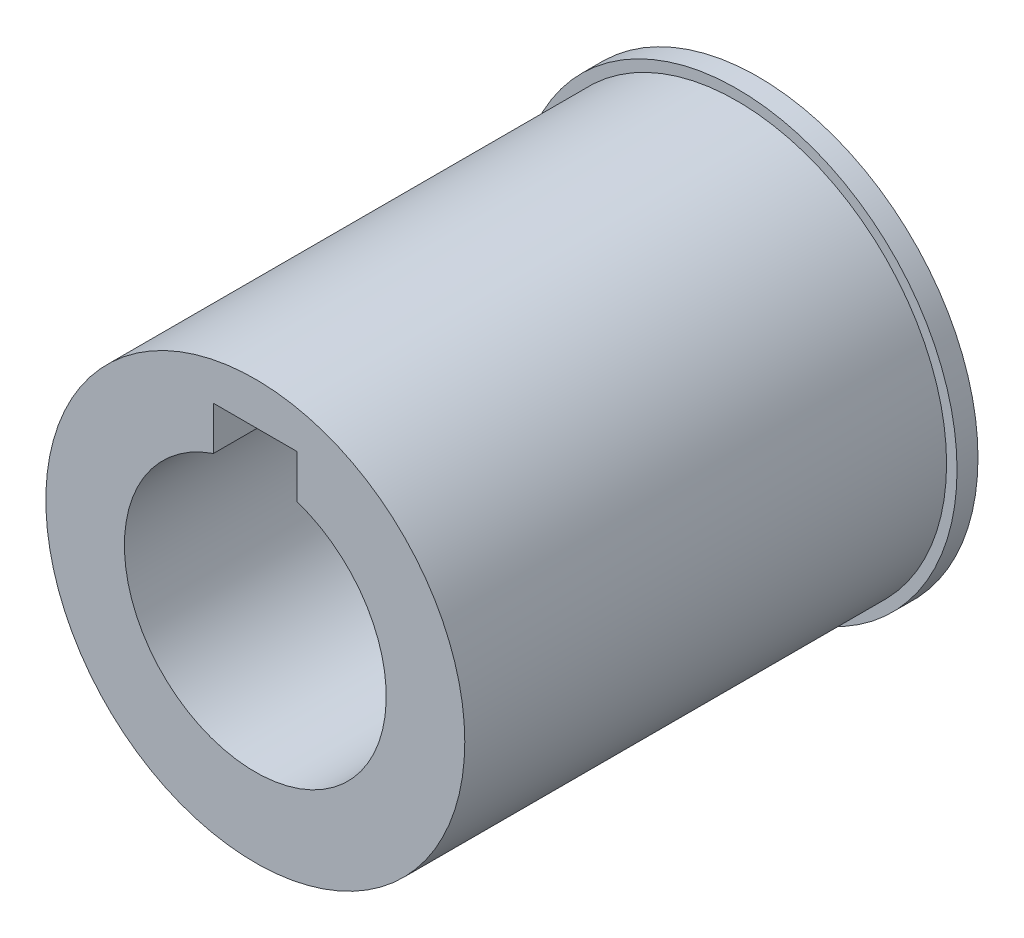
ISO-10303-21;
HEADER;
FILE_DESCRIPTION(('STEP AP214'),'2;1');
FILE_NAME('part.step','',(''),(''),'','','');
FILE_SCHEMA(('AUTOMOTIVE_DESIGN { 1 0 10303 214 1 1 1 1 }'));
ENDSEC;
DATA;
#1=APPLICATION_CONTEXT('core data for automotive mechanical design processes');
#2=APPLICATION_PROTOCOL_DEFINITION('international standard','automotive_design',2000,#1);
#3=PRODUCT_CONTEXT('',#1,'mechanical');
#4=PRODUCT('Part','Part','',(#3));
#5=PRODUCT_RELATED_PRODUCT_CATEGORY('part','',(#4));
#6=PRODUCT_DEFINITION_FORMATION('','',#4);
#7=PRODUCT_DEFINITION_CONTEXT('part definition',#1,'design');
#8=PRODUCT_DEFINITION('design','',#6,#7);
#9=PRODUCT_DEFINITION_SHAPE('','',#8);
#10=(LENGTH_UNIT() NAMED_UNIT(*) SI_UNIT(.MILLI.,.METRE.));
#11=(NAMED_UNIT(*) PLANE_ANGLE_UNIT() SI_UNIT($,.RADIAN.));
#12=(NAMED_UNIT(*) SI_UNIT($,.STERADIAN.) SOLID_ANGLE_UNIT());
#13=UNCERTAINTY_MEASURE_WITH_UNIT(LENGTH_MEASURE(1.E-05),#10,'distance_accuracy_value','');
#14=(GEOMETRIC_REPRESENTATION_CONTEXT(3) GLOBAL_UNCERTAINTY_ASSIGNED_CONTEXT((#13)) GLOBAL_UNIT_ASSIGNED_CONTEXT((#10,
#11,#12)) REPRESENTATION_CONTEXT('',''));
#15=CARTESIAN_POINT('',(0.,0.,0.));
#16=DIRECTION('',(0.,0.,1.));
#17=DIRECTION('',(1.,0.,0.));
#18=AXIS2_PLACEMENT_3D('',#15,#16,#17);
#19=CARTESIAN_POINT('',(0.,0.,2.));
#20=DIRECTION('',(0.,0.,-1.));
#21=DIRECTION('',(-1.,0.,0.));
#22=AXIS2_PLACEMENT_3D('',#19,#20,#21);
#23=CYLINDRICAL_SURFACE('',#22,21.);
#24=CARTESIAN_POINT('',(0.,0.,2.));
#25=DIRECTION('',(0.,0.,1.));
#26=DIRECTION('',(1.,0.,0.));
#27=AXIS2_PLACEMENT_3D('',#24,#25,#26);
#28=CIRCLE('',#27,21.);
#29=CARTESIAN_POINT('',(21.,0.,2.));
#30=VERTEX_POINT('',#29);
#31=EDGE_CURVE('E128',#30,#30,#28,.T.);
#32=ORIENTED_EDGE('',*,*,#31,.F.);
#33=EDGE_LOOP('',(#32));
#34=FACE_BOUND('',#33,.T.);
#35=CARTESIAN_POINT('',(0.,0.,0.));
#36=DIRECTION('',(0.,0.,1.));
#37=DIRECTION('',(1.,0.,0.));
#38=AXIS2_PLACEMENT_3D('',#35,#36,#37);
#39=CIRCLE('',#38,21.);
#40=CARTESIAN_POINT('',(21.,0.,0.));
#41=VERTEX_POINT('',#40);
#42=EDGE_CURVE('E123',#41,#41,#39,.T.);
#43=ORIENTED_EDGE('',*,*,#42,.T.);
#44=EDGE_LOOP('',(#43));
#45=FACE_BOUND('',#44,.T.);
#46=ADVANCED_FACE('F39',(#34,#45),#23,.T.);
#47=CARTESIAN_POINT('',(0.,0.,2.));
#48=DIRECTION('',(0.,0.,1.));
#49=DIRECTION('',(1.,0.,0.));
#50=AXIS2_PLACEMENT_3D('',#47,#48,#49);
#51=PLANE('',#50);
#52=CARTESIAN_POINT('',(0.,0.,2.));
#53=DIRECTION('',(0.,0.,1.));
#54=DIRECTION('',(1.,0.,0.));
#55=AXIS2_PLACEMENT_3D('',#52,#53,#54);
#56=CIRCLE('',#55,20.);
#57=CARTESIAN_POINT('',(20.,0.,2.));
#58=VERTEX_POINT('',#57);
#59=EDGE_CURVE('E124',#58,#58,#56,.T.);
#60=ORIENTED_EDGE('',*,*,#59,.F.);
#61=EDGE_LOOP('',(#60));
#62=FACE_BOUND('',#61,.T.);
#63=ORIENTED_EDGE('',*,*,#31,.T.);
#64=EDGE_LOOP('',(#63));
#65=FACE_BOUND('',#64,.T.);
#66=ADVANCED_FACE('F147',(#62,#65),#51,.T.);
#67=CARTESIAN_POINT('',(0.,0.,0.));
#68=DIRECTION('',(0.,0.,1.));
#69=DIRECTION('',(1.,0.,0.));
#70=AXIS2_PLACEMENT_3D('',#67,#68,#69);
#71=PLANE('',#70);
#72=CARTESIAN_POINT('',(0.,0.,0.));
#73=DIRECTION('',(0.,0.,-1.));
#74=DIRECTION('',(-1.,0.,0.));
#75=AXIS2_PLACEMENT_3D('',#72,#73,#74);
#76=CIRCLE('',#75,12.5);
#77=CARTESIAN_POINT('',(4.,11.842719282327,0.));
#78=VERTEX_POINT('',#77);
#79=CARTESIAN_POINT('',(-4.,11.842719282327,0.));
#80=VERTEX_POINT('',#79);
#81=EDGE_CURVE('E112',#78,#80,#76,.T.);
#82=ORIENTED_EDGE('',*,*,#81,.F.);
#83=DIRECTION('',(0.,-1.,0.));
#84=VECTOR('',#83,1.);
#85=CARTESIAN_POINT('',(4.,9.,0.));
#86=LINE('',#85,#84);
#87=CARTESIAN_POINT('',(4.,16.,0.));
#88=VERTEX_POINT('',#87);
#89=EDGE_CURVE('E62',#88,#78,#86,.T.);
#90=ORIENTED_EDGE('',*,*,#89,.F.);
#91=DIRECTION('',(1.,0.,0.));
#92=VECTOR('',#91,1.);
#93=CARTESIAN_POINT('',(4.,16.,0.));
#94=LINE('',#93,#92);
#95=CARTESIAN_POINT('',(-4.,16.,0.));
#96=VERTEX_POINT('',#95);
#97=EDGE_CURVE('E94',#96,#88,#94,.T.);
#98=ORIENTED_EDGE('',*,*,#97,.F.);
#99=DIRECTION('',(0.,1.,0.));
#100=VECTOR('',#99,1.);
#101=CARTESIAN_POINT('',(-4.,9.,0.));
#102=LINE('',#101,#100);
#103=EDGE_CURVE('E105',#80,#96,#102,.T.);
#104=ORIENTED_EDGE('',*,*,#103,.F.);
#105=EDGE_LOOP('',(#82,#90,#98,#104));
#106=FACE_BOUND('',#105,.T.);
#107=ORIENTED_EDGE('',*,*,#42,.F.);
#108=EDGE_LOOP('',(#107));
#109=FACE_BOUND('',#108,.T.);
#110=ADVANCED_FACE('F141',(#106,#109),#71,.F.);
#111=CARTESIAN_POINT('',(0.,0.,48.));
#112=DIRECTION('',(0.,0.,-1.));
#113=DIRECTION('',(-1.,0.,0.));
#114=AXIS2_PLACEMENT_3D('',#111,#112,#113);
#115=CYLINDRICAL_SURFACE('',#114,20.);
#116=CARTESIAN_POINT('',(0.,0.,48.));
#117=DIRECTION('',(0.,0.,1.));
#118=DIRECTION('',(1.,0.,0.));
#119=AXIS2_PLACEMENT_3D('',#116,#117,#118);
#120=CIRCLE('',#119,20.);
#121=CARTESIAN_POINT('',(20.,0.,48.));
#122=VERTEX_POINT('',#121);
#123=EDGE_CURVE('E116',#122,#122,#120,.T.);
#124=ORIENTED_EDGE('',*,*,#123,.F.);
#125=EDGE_LOOP('',(#124));
#126=FACE_BOUND('',#125,.T.);
#127=ORIENTED_EDGE('',*,*,#59,.T.);
#128=EDGE_LOOP('',(#127));
#129=FACE_BOUND('',#128,.T.);
#130=ADVANCED_FACE('F146',(#126,#129),#115,.T.);
#131=CARTESIAN_POINT('',(0.,0.,48.));
#132=DIRECTION('',(0.,0.,1.));
#133=DIRECTION('',(1.,0.,0.));
#134=AXIS2_PLACEMENT_3D('',#131,#132,#133);
#135=PLANE('',#134);
#136=DIRECTION('',(0.,-1.,0.));
#137=VECTOR('',#136,1.);
#138=CARTESIAN_POINT('',(4.,9.,48.));
#139=LINE('',#138,#137);
#140=CARTESIAN_POINT('',(4.,16.,48.));
#141=VERTEX_POINT('',#140);
#142=CARTESIAN_POINT('',(4.,11.842719282327,48.));
#143=VERTEX_POINT('',#142);
#144=EDGE_CURVE('E78',#141,#143,#139,.T.);
#145=ORIENTED_EDGE('',*,*,#144,.T.);
#146=CARTESIAN_POINT('',(0.,0.,48.));
#147=DIRECTION('',(0.,0.,-1.));
#148=DIRECTION('',(-1.,0.,0.));
#149=AXIS2_PLACEMENT_3D('',#146,#147,#148);
#150=CIRCLE('',#149,12.5);
#151=CARTESIAN_POINT('',(-4.,11.842719282327,48.));
#152=VERTEX_POINT('',#151);
#153=EDGE_CURVE('E113',#143,#152,#150,.T.);
#154=ORIENTED_EDGE('',*,*,#153,.T.);
#155=DIRECTION('',(0.,1.,0.));
#156=VECTOR('',#155,1.);
#157=CARTESIAN_POINT('',(-4.,9.,48.));
#158=LINE('',#157,#156);
#159=CARTESIAN_POINT('',(-4.,16.,48.));
#160=VERTEX_POINT('',#159);
#161=EDGE_CURVE('E54',#152,#160,#158,.T.);
#162=ORIENTED_EDGE('',*,*,#161,.T.);
#163=DIRECTION('',(1.,0.,0.));
#164=VECTOR('',#163,1.);
#165=CARTESIAN_POINT('',(4.,16.,48.));
#166=LINE('',#165,#164);
#167=EDGE_CURVE('E92',#160,#141,#166,.T.);
#168=ORIENTED_EDGE('',*,*,#167,.T.);
#169=EDGE_LOOP('',(#145,#154,#162,#168));
#170=FACE_BOUND('',#169,.T.);
#171=ORIENTED_EDGE('',*,*,#123,.T.);
#172=EDGE_LOOP('',(#171));
#173=FACE_BOUND('',#172,.T.);
#174=ADVANCED_FACE('F97',(#170,#173),#135,.T.);
#175=CARTESIAN_POINT('',(0.,0.,48.));
#176=DIRECTION('',(0.,0.,-1.));
#177=DIRECTION('',(-1.,0.,0.));
#178=AXIS2_PLACEMENT_3D('',#175,#176,#177);
#179=CYLINDRICAL_SURFACE('',#178,12.5);
#180=ORIENTED_EDGE('',*,*,#153,.F.);
#181=DIRECTION('',(0.,0.,-1.));
#182=VECTOR('',#181,1.);
#183=CARTESIAN_POINT('',(4.,11.842719282327,48.));
#184=LINE('',#183,#182);
#185=EDGE_CURVE('E11',#143,#78,#184,.T.);
#186=ORIENTED_EDGE('',*,*,#185,.T.);
#187=ORIENTED_EDGE('',*,*,#81,.T.);
#188=DIRECTION('',(0.,0.,-1.));
#189=VECTOR('',#188,1.);
#190=CARTESIAN_POINT('',(-4.,11.842719282327,48.));
#191=LINE('',#190,#189);
#192=EDGE_CURVE('E47',#80,#152,#191,.F.);
#193=ORIENTED_EDGE('',*,*,#192,.T.);
#194=EDGE_LOOP('',(#180,#186,#187,#193));
#195=FACE_BOUND('',#194,.T.);
#196=ADVANCED_FACE('F136',(#195),#179,.F.);
#197=CARTESIAN_POINT('',(4.,9.,58.6301458127347));
#198=DIRECTION('',(1.,0.,0.));
#199=DIRECTION('',(0.,0.,-1.));
#200=AXIS2_PLACEMENT_3D('',#197,#198,#199);
#201=PLANE('',#200);
#202=ORIENTED_EDGE('',*,*,#144,.F.);
#203=DIRECTION('',(0.,0.,-1.));
#204=VECTOR('',#203,1.);
#205=CARTESIAN_POINT('',(4.,16.,58.6301458127347));
#206=LINE('',#205,#204);
#207=EDGE_CURVE('E81',#141,#88,#206,.T.);
#208=ORIENTED_EDGE('',*,*,#207,.T.);
#209=ORIENTED_EDGE('',*,*,#89,.T.);
#210=ORIENTED_EDGE('',*,*,#185,.F.);
#211=EDGE_LOOP('',(#202,#208,#209,#210));
#212=FACE_BOUND('',#211,.T.);
#213=ADVANCED_FACE('F80',(#212),#201,.F.);
#214=CARTESIAN_POINT('',(-4.,9.,58.6301458127347));
#215=DIRECTION('',(-1.,0.,0.));
#216=DIRECTION('',(0.,-1.,0.));
#217=AXIS2_PLACEMENT_3D('',#214,#215,#216);
#218=PLANE('',#217);
#219=ORIENTED_EDGE('',*,*,#103,.T.);
#220=DIRECTION('',(0.,0.,-1.));
#221=VECTOR('',#220,1.);
#222=CARTESIAN_POINT('',(-4.,16.,58.6301458127347));
#223=LINE('',#222,#221);
#224=EDGE_CURVE('E108',#160,#96,#223,.T.);
#225=ORIENTED_EDGE('',*,*,#224,.F.);
#226=ORIENTED_EDGE('',*,*,#161,.F.);
#227=ORIENTED_EDGE('',*,*,#192,.F.);
#228=EDGE_LOOP('',(#219,#225,#226,#227));
#229=FACE_BOUND('',#228,.T.);
#230=ADVANCED_FACE('F139',(#229),#218,.F.);
#231=CARTESIAN_POINT('',(4.,16.,58.6301458127347));
#232=DIRECTION('',(0.,1.,0.));
#233=DIRECTION('',(0.,0.,1.));
#234=AXIS2_PLACEMENT_3D('',#231,#232,#233);
#235=PLANE('',#234);
#236=ORIENTED_EDGE('',*,*,#224,.T.);
#237=ORIENTED_EDGE('',*,*,#97,.T.);
#238=ORIENTED_EDGE('',*,*,#207,.F.);
#239=ORIENTED_EDGE('',*,*,#167,.F.);
#240=EDGE_LOOP('',(#236,#237,#238,#239));
#241=FACE_BOUND('',#240,.T.);
#242=ADVANCED_FACE('F91',(#241),#235,.F.);
#243=CLOSED_SHELL('',(#46,#66,#110,#130,#174,#196,#213,#230,#242));
#244=MANIFOLD_SOLID_BREP('B2',#243);
#245=ADVANCED_BREP_SHAPE_REPRESENTATION('',(#18,#244),#14);
#246=SHAPE_DEFINITION_REPRESENTATION(#9,#245);
ENDSEC;
END-ISO-10303-21;
